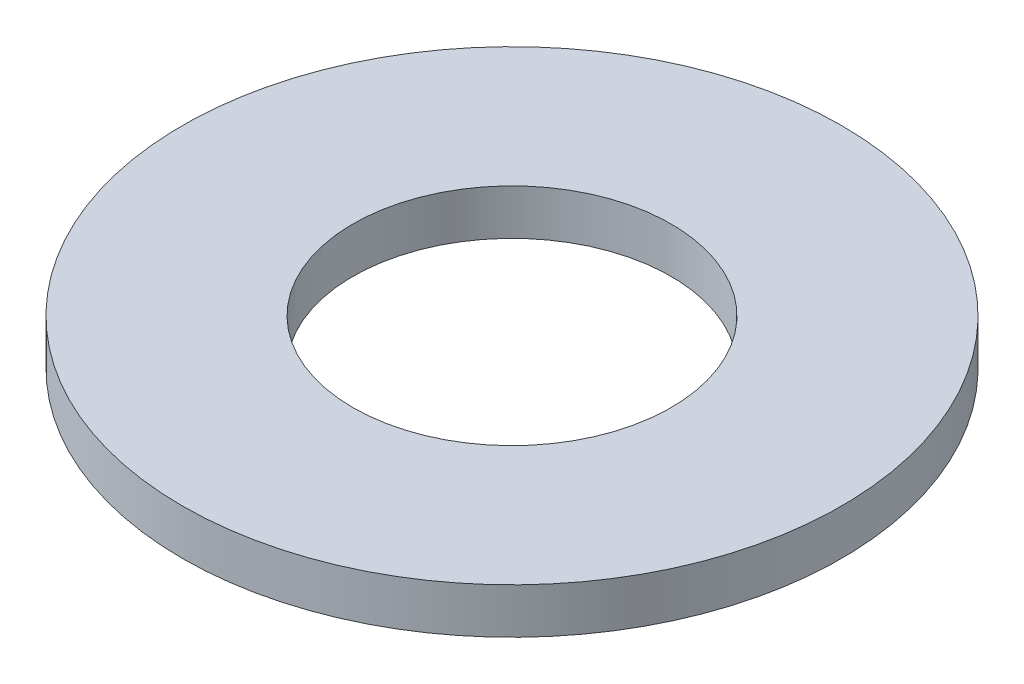
ISO-10303-21;
HEADER;
FILE_DESCRIPTION(('STEP AP214'),'2;1');
FILE_NAME('part.step','',(''),(''),'','','');
FILE_SCHEMA(('AUTOMOTIVE_DESIGN { 1 0 10303 214 1 1 1 1 }'));
ENDSEC;
DATA;
#1=APPLICATION_CONTEXT('core data for automotive mechanical design processes');
#2=APPLICATION_PROTOCOL_DEFINITION('international standard','automotive_design',2000,#1);
#3=PRODUCT_CONTEXT('',#1,'mechanical');
#4=PRODUCT('Part','Part','',(#3));
#5=PRODUCT_RELATED_PRODUCT_CATEGORY('part','',(#4));
#6=PRODUCT_DEFINITION_FORMATION('','',#4);
#7=PRODUCT_DEFINITION_CONTEXT('part definition',#1,'design');
#8=PRODUCT_DEFINITION('design','',#6,#7);
#9=PRODUCT_DEFINITION_SHAPE('','',#8);
#10=(LENGTH_UNIT() NAMED_UNIT(*) SI_UNIT(.MILLI.,.METRE.));
#11=(NAMED_UNIT(*) PLANE_ANGLE_UNIT() SI_UNIT($,.RADIAN.));
#12=(NAMED_UNIT(*) SI_UNIT($,.STERADIAN.) SOLID_ANGLE_UNIT());
#13=UNCERTAINTY_MEASURE_WITH_UNIT(LENGTH_MEASURE(1.E-05),#10,'distance_accuracy_value','');
#14=(GEOMETRIC_REPRESENTATION_CONTEXT(3) GLOBAL_UNCERTAINTY_ASSIGNED_CONTEXT((#13)) GLOBAL_UNIT_ASSIGNED_CONTEXT((#10,
#11,#12)) REPRESENTATION_CONTEXT('',''));
#15=CARTESIAN_POINT('',(0.,0.,0.));
#16=DIRECTION('',(0.,0.,1.));
#17=DIRECTION('',(1.,0.,0.));
#18=AXIS2_PLACEMENT_3D('',#15,#16,#17);
#19=CARTESIAN_POINT('',(0.,10.,0.));
#20=DIRECTION('',(0.,-1.,0.));
#21=DIRECTION('',(0.,0.,-1.));
#22=AXIS2_PLACEMENT_3D('',#19,#20,#21);
#23=CYLINDRICAL_SURFACE('',#22,72.5);
#24=CARTESIAN_POINT('',(0.,10.,0.));
#25=DIRECTION('',(0.,1.,0.));
#26=DIRECTION('',(0.,0.,1.));
#27=AXIS2_PLACEMENT_3D('',#24,#25,#26);
#28=CIRCLE('',#27,72.5);
#29=CARTESIAN_POINT('',(0.,10.,72.5));
#30=VERTEX_POINT('',#29);
#31=EDGE_CURVE('E10',#30,#30,#28,.T.);
#32=ORIENTED_EDGE('',*,*,#31,.F.);
#33=EDGE_LOOP('',(#32));
#34=FACE_BOUND('',#33,.T.);
#35=CARTESIAN_POINT('',(0.,0.,0.));
#36=DIRECTION('',(0.,1.,0.));
#37=DIRECTION('',(0.,0.,1.));
#38=AXIS2_PLACEMENT_3D('',#35,#36,#37);
#39=CIRCLE('',#38,72.5);
#40=CARTESIAN_POINT('',(0.,0.,72.5));
#41=VERTEX_POINT('',#40);
#42=EDGE_CURVE('E37',#41,#41,#39,.T.);
#43=ORIENTED_EDGE('',*,*,#42,.T.);
#44=EDGE_LOOP('',(#43));
#45=FACE_BOUND('',#44,.T.);
#46=ADVANCED_FACE('F40',(#34,#45),#23,.T.);
#47=CARTESIAN_POINT('',(0.,10.,0.));
#48=DIRECTION('',(0.,1.,0.));
#49=DIRECTION('',(0.,0.,1.));
#50=AXIS2_PLACEMENT_3D('',#47,#48,#49);
#51=PLANE('',#50);
#52=CARTESIAN_POINT('',(0.,10.,0.));
#53=DIRECTION('',(0.,1.,0.));
#54=DIRECTION('',(0.,0.,1.));
#55=AXIS2_PLACEMENT_3D('',#52,#53,#54);
#56=CIRCLE('',#55,35.);
#57=CARTESIAN_POINT('',(0.,10.,35.));
#58=VERTEX_POINT('',#57);
#59=EDGE_CURVE('E50',#58,#58,#56,.T.);
#60=ORIENTED_EDGE('',*,*,#59,.F.);
#61=EDGE_LOOP('',(#60));
#62=FACE_BOUND('',#61,.T.);
#63=ORIENTED_EDGE('',*,*,#31,.T.);
#64=EDGE_LOOP('',(#63));
#65=FACE_BOUND('',#64,.T.);
#66=ADVANCED_FACE('F59',(#62,#65),#51,.T.);
#67=CARTESIAN_POINT('',(0.,0.,0.));
#68=DIRECTION('',(0.,1.,0.));
#69=DIRECTION('',(0.,0.,1.));
#70=AXIS2_PLACEMENT_3D('',#67,#68,#69);
#71=PLANE('',#70);
#72=CARTESIAN_POINT('',(0.,0.,0.));
#73=DIRECTION('',(0.,1.,0.));
#74=DIRECTION('',(0.,0.,1.));
#75=AXIS2_PLACEMENT_3D('',#72,#73,#74);
#76=CIRCLE('',#75,35.);
#77=CARTESIAN_POINT('',(0.,0.,35.));
#78=VERTEX_POINT('',#77);
#79=EDGE_CURVE('E47',#78,#78,#76,.T.);
#80=ORIENTED_EDGE('',*,*,#79,.T.);
#81=EDGE_LOOP('',(#80));
#82=FACE_BOUND('',#81,.T.);
#83=ORIENTED_EDGE('',*,*,#42,.F.);
#84=EDGE_LOOP('',(#83));
#85=FACE_BOUND('',#84,.T.);
#86=ADVANCED_FACE('F58',(#82,#85),#71,.F.);
#87=CARTESIAN_POINT('',(0.,10.,0.));
#88=DIRECTION('',(0.,-1.,0.));
#89=DIRECTION('',(0.,0.,-1.));
#90=AXIS2_PLACEMENT_3D('',#87,#88,#89);
#91=CYLINDRICAL_SURFACE('',#90,35.);
#92=ORIENTED_EDGE('',*,*,#59,.T.);
#93=EDGE_LOOP('',(#92));
#94=FACE_BOUND('',#93,.T.);
#95=ORIENTED_EDGE('',*,*,#79,.F.);
#96=EDGE_LOOP('',(#95));
#97=FACE_BOUND('',#96,.T.);
#98=ADVANCED_FACE('F54',(#94,#97),#91,.F.);
#99=CLOSED_SHELL('',(#46,#66,#86,#98));
#100=MANIFOLD_SOLID_BREP('B2',#99);
#101=ADVANCED_BREP_SHAPE_REPRESENTATION('',(#18,#100),#14);
#102=SHAPE_DEFINITION_REPRESENTATION(#9,#101);
ENDSEC;
END-ISO-10303-21;
